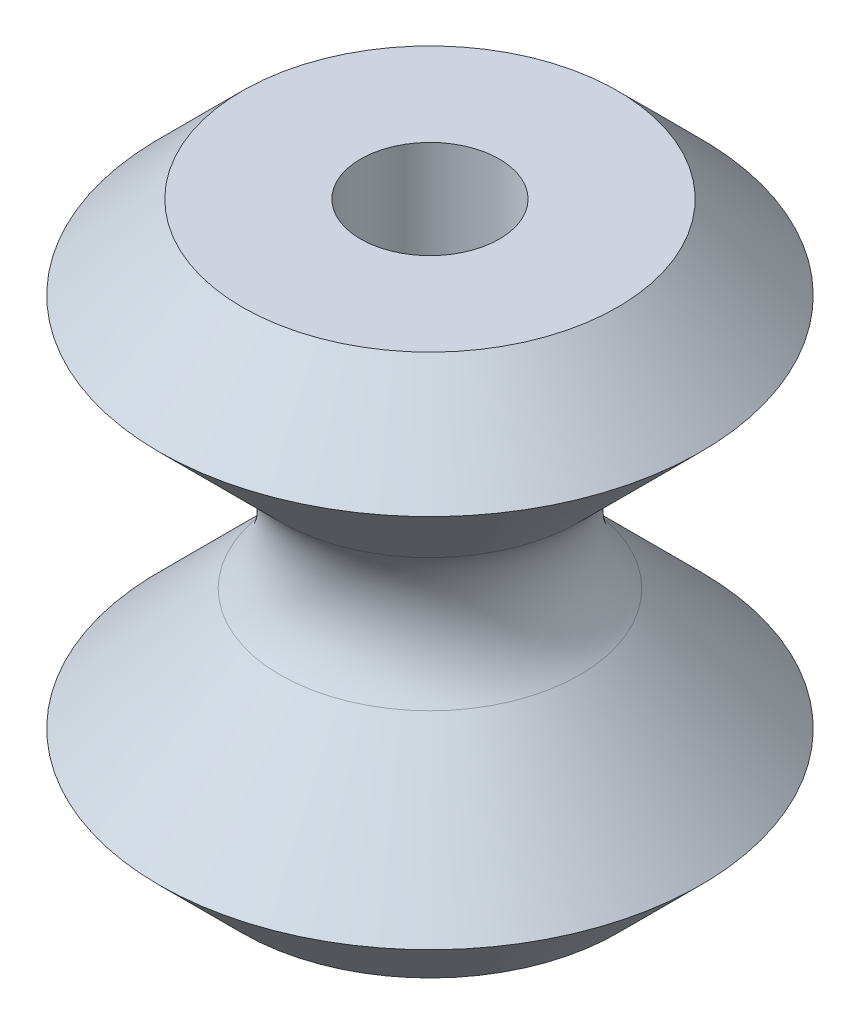
ISO-10303-21;
HEADER;
FILE_DESCRIPTION(('STEP AP214'),'2;1');
FILE_NAME('part.step','',(''),(''),'','','');
FILE_SCHEMA(('AUTOMOTIVE_DESIGN { 1 0 10303 214 1 1 1 1 }'));
ENDSEC;
DATA;
#1=APPLICATION_CONTEXT('core data for automotive mechanical design processes');
#2=APPLICATION_PROTOCOL_DEFINITION('international standard','automotive_design',2000,#1);
#3=PRODUCT_CONTEXT('',#1,'mechanical');
#4=PRODUCT('Part','Part','',(#3));
#5=PRODUCT_RELATED_PRODUCT_CATEGORY('part','',(#4));
#6=PRODUCT_DEFINITION_FORMATION('','',#4);
#7=PRODUCT_DEFINITION_CONTEXT('part definition',#1,'design');
#8=PRODUCT_DEFINITION('design','',#6,#7);
#9=PRODUCT_DEFINITION_SHAPE('','',#8);
#10=(LENGTH_UNIT() NAMED_UNIT(*) SI_UNIT(.MILLI.,.METRE.));
#11=(NAMED_UNIT(*) PLANE_ANGLE_UNIT() SI_UNIT($,.RADIAN.));
#12=(NAMED_UNIT(*) SI_UNIT($,.STERADIAN.) SOLID_ANGLE_UNIT());
#13=UNCERTAINTY_MEASURE_WITH_UNIT(LENGTH_MEASURE(1.E-05),#10,'distance_accuracy_value','');
#14=(GEOMETRIC_REPRESENTATION_CONTEXT(3) GLOBAL_UNCERTAINTY_ASSIGNED_CONTEXT((#13)) GLOBAL_UNIT_ASSIGNED_CONTEXT((#10,
#11,#12)) REPRESENTATION_CONTEXT('',''));
#15=CARTESIAN_POINT('',(0.,0.,0.));
#16=DIRECTION('',(0.,0.,1.));
#17=DIRECTION('',(1.,0.,0.));
#18=AXIS2_PLACEMENT_3D('',#15,#16,#17);
#19=CARTESIAN_POINT('',(0.,18.3515,0.));
#20=DIRECTION('',(0.,-1.,0.));
#21=DIRECTION('',(0.,0.,-1.));
#22=AXIS2_PLACEMENT_3D('',#19,#20,#21);
#23=PLANE('',#22);
#24=CARTESIAN_POINT('',(0.,18.3515,0.));
#25=DIRECTION('',(0.,1.,0.));
#26=DIRECTION('',(0.,0.,1.));
#27=AXIS2_PLACEMENT_3D('',#24,#25,#26);
#28=CIRCLE('',#27,2.3495);
#29=CARTESIAN_POINT('',(0.,18.3515,2.3495));
#30=VERTEX_POINT('',#29);
#31=EDGE_CURVE('E62',#30,#30,#28,.T.);
#32=ORIENTED_EDGE('',*,*,#31,.F.);
#33=EDGE_LOOP('',(#32));
#34=FACE_BOUND('',#33,.T.);
#35=CARTESIAN_POINT('',(0.,18.3515,0.));
#36=DIRECTION('',(0.,1.,0.));
#37=DIRECTION('',(0.,0.,1.));
#38=AXIS2_PLACEMENT_3D('',#35,#36,#37);
#39=CIRCLE('',#38,6.35);
#40=CARTESIAN_POINT('',(0.,18.3515,6.35));
#41=VERTEX_POINT('',#40);
#42=EDGE_CURVE('E46',#41,#41,#39,.T.);
#43=ORIENTED_EDGE('',*,*,#42,.T.);
#44=EDGE_LOOP('',(#43));
#45=FACE_BOUND('',#44,.T.);
#46=ADVANCED_FACE('F35',(#34,#45),#23,.F.);
#47=CARTESIAN_POINT('',(0.,15.52575,0.));
#48=DIRECTION('',(0.,-1.,0.));
#49=DIRECTION('',(0.,0.,-1.));
#50=AXIS2_PLACEMENT_3D('',#47,#48,#49);
#51=CONICAL_SURFACE('',#50,9.17575,0.785398163397446);
#52=ORIENTED_EDGE('',*,*,#42,.F.);
#53=EDGE_LOOP('',(#52));
#54=FACE_BOUND('',#53,.T.);
#55=CARTESIAN_POINT('',(0.,15.52575,0.));
#56=DIRECTION('',(0.,1.,0.));
#57=DIRECTION('',(0.,0.,1.));
#58=AXIS2_PLACEMENT_3D('',#55,#56,#57);
#59=CIRCLE('',#58,9.17575);
#60=CARTESIAN_POINT('',(0.,15.52575,9.17575));
#61=VERTEX_POINT('',#60);
#62=EDGE_CURVE('E50',#61,#61,#59,.T.);
#63=ORIENTED_EDGE('',*,*,#62,.T.);
#64=EDGE_LOOP('',(#63));
#65=FACE_BOUND('',#64,.T.);
#66=ADVANCED_FACE('F79',(#54,#65),#51,.T.);
#67=CARTESIAN_POINT('',(0.,9.17575,0.));
#68=DIRECTION('',(0.,1.,0.));
#69=DIRECTION('',(0.,0.,1.));
#70=AXIS2_PLACEMENT_3D('',#67,#68,#69);
#71=CONICAL_SURFACE('',#70,2.82574999999999,0.78539816339745);
#72=CARTESIAN_POINT('',(0.,11.4208140302673,0.));
#73=DIRECTION('',(0.,1.,0.));
#74=DIRECTION('',(0.,0.,1.));
#75=AXIS2_PLACEMENT_3D('',#72,#73,#74);
#76=CIRCLE('',#75,5.07081403026728);
#77=CARTESIAN_POINT('',(0.,11.4208140302673,5.07081403026728));
#78=VERTEX_POINT('',#77);
#79=EDGE_CURVE('E42',#78,#78,#76,.T.);
#80=ORIENTED_EDGE('',*,*,#79,.T.);
#81=EDGE_LOOP('',(#80));
#82=FACE_BOUND('',#81,.T.);
#83=ORIENTED_EDGE('',*,*,#62,.F.);
#84=EDGE_LOOP('',(#83));
#85=FACE_BOUND('',#84,.T.);
#86=ADVANCED_FACE('F84',(#82,#85),#71,.T.);
#87=CARTESIAN_POINT('',(0.,2.82574999999997,0.));
#88=DIRECTION('',(0.,-1.,0.));
#89=DIRECTION('',(0.,0.,-1.));
#90=AXIS2_PLACEMENT_3D('',#87,#88,#89);
#91=CONICAL_SURFACE('',#90,9.17575,0.785398163397447);
#92=CARTESIAN_POINT('',(0.,6.93068596973271,0.));
#93=DIRECTION('',(0.,-1.,0.));
#94=DIRECTION('',(0.,0.,-1.));
#95=AXIS2_PLACEMENT_3D('',#92,#93,#94);
#96=CIRCLE('',#95,5.07081403026728);
#97=CARTESIAN_POINT('',(0.,6.93068596973271,-5.07081403026728));
#98=VERTEX_POINT('',#97);
#99=EDGE_CURVE('E10',#98,#98,#96,.T.);
#100=ORIENTED_EDGE('',*,*,#99,.T.);
#101=EDGE_LOOP('',(#100));
#102=FACE_BOUND('',#101,.T.);
#103=CARTESIAN_POINT('',(0.,2.82574999999997,0.));
#104=DIRECTION('',(0.,1.,0.));
#105=DIRECTION('',(0.,0.,1.));
#106=AXIS2_PLACEMENT_3D('',#103,#104,#105);
#107=CIRCLE('',#106,9.17575);
#108=CARTESIAN_POINT('',(0.,2.82574999999997,9.17575));
#109=VERTEX_POINT('',#108);
#110=EDGE_CURVE('E55',#109,#109,#107,.T.);
#111=ORIENTED_EDGE('',*,*,#110,.T.);
#112=EDGE_LOOP('',(#111));
#113=FACE_BOUND('',#112,.T.);
#114=ADVANCED_FACE('F89',(#102,#113),#91,.T.);
#115=CARTESIAN_POINT('',(0.,0.,0.));
#116=DIRECTION('',(0.,1.,0.));
#117=DIRECTION('',(0.,0.,1.));
#118=AXIS2_PLACEMENT_3D('',#115,#116,#117);
#119=CONICAL_SURFACE('',#118,6.35,0.785398163397454);
#120=ORIENTED_EDGE('',*,*,#110,.F.);
#121=EDGE_LOOP('',(#120));
#122=FACE_BOUND('',#121,.T.);
#123=CARTESIAN_POINT('',(0.,0.,0.));
#124=DIRECTION('',(0.,1.,0.));
#125=DIRECTION('',(0.,0.,1.));
#126=AXIS2_PLACEMENT_3D('',#123,#124,#125);
#127=CIRCLE('',#126,6.35);
#128=CARTESIAN_POINT('',(0.,0.,6.35));
#129=VERTEX_POINT('',#128);
#130=EDGE_CURVE('E58',#129,#129,#127,.T.);
#131=ORIENTED_EDGE('',*,*,#130,.T.);
#132=EDGE_LOOP('',(#131));
#133=FACE_BOUND('',#132,.T.);
#134=ADVANCED_FACE('F94',(#122,#133),#119,.T.);
#135=CARTESIAN_POINT('',(6.35,0.,0.));
#136=DIRECTION('',(0.,1.,0.));
#137=DIRECTION('',(0.,0.,1.));
#138=AXIS2_PLACEMENT_3D('',#135,#136,#137);
#139=PLANE('',#138);
#140=CARTESIAN_POINT('',(0.,0.,0.));
#141=DIRECTION('',(0.,1.,0.));
#142=DIRECTION('',(0.,0.,1.));
#143=AXIS2_PLACEMENT_3D('',#140,#141,#142);
#144=CIRCLE('',#143,2.3495);
#145=CARTESIAN_POINT('',(0.,0.,2.3495));
#146=VERTEX_POINT('',#145);
#147=EDGE_CURVE('E61',#146,#146,#144,.T.);
#148=ORIENTED_EDGE('',*,*,#147,.T.);
#149=EDGE_LOOP('',(#148));
#150=FACE_BOUND('',#149,.T.);
#151=ORIENTED_EDGE('',*,*,#130,.F.);
#152=EDGE_LOOP('',(#151));
#153=FACE_BOUND('',#152,.T.);
#154=ADVANCED_FACE('F68',(#150,#153),#139,.F.);
#155=CARTESIAN_POINT('',(0.,0.,0.));
#156=DIRECTION('',(0.,1.,0.));
#157=DIRECTION('',(0.,0.,1.));
#158=AXIS2_PLACEMENT_3D('',#155,#156,#157);
#159=CYLINDRICAL_SURFACE('',#158,2.3495);
#160=ORIENTED_EDGE('',*,*,#147,.F.);
#161=EDGE_LOOP('',(#160));
#162=FACE_BOUND('',#161,.T.);
#163=ORIENTED_EDGE('',*,*,#31,.T.);
#164=EDGE_LOOP('',(#163));
#165=FACE_BOUND('',#164,.T.);
#166=ADVANCED_FACE('F71',(#162,#165),#159,.F.);
#167=CARTESIAN_POINT('',(0.,9.17574999999999,0.));
#168=DIRECTION('',(0.,1.,0.));
#169=DIRECTION('',(0.,0.,1.));
#170=AXIS2_PLACEMENT_3D('',#167,#168,#169);
#171=TOROIDAL_SURFACE('',#170,7.31587806053457,3.175);
#172=ORIENTED_EDGE('',*,*,#99,.F.);
#173=EDGE_LOOP('',(#172));
#174=FACE_BOUND('',#173,.T.);
#175=ORIENTED_EDGE('',*,*,#79,.F.);
#176=EDGE_LOOP('',(#175));
#177=FACE_BOUND('',#176,.T.);
#178=ADVANCED_FACE('F37',(#174,#177),#171,.F.);
#179=CLOSED_SHELL('',(#46,#66,#86,#114,#134,#154,#166,#178));
#180=MANIFOLD_SOLID_BREP('B2',#179);
#181=ADVANCED_BREP_SHAPE_REPRESENTATION('',(#18,#180),#14);
#182=SHAPE_DEFINITION_REPRESENTATION(#9,#181);
ENDSEC;
END-ISO-10303-21;
